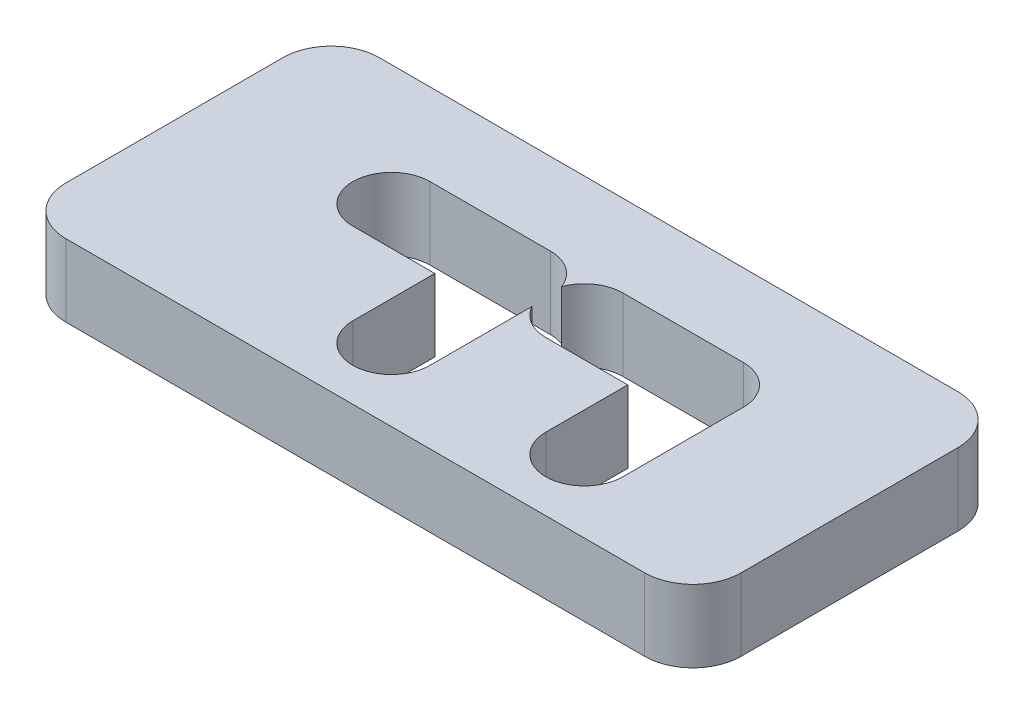
ISO-10303-21;
HEADER;
FILE_DESCRIPTION(('STEP AP214'),'2;1');
FILE_NAME('part.step','',(''),(''),'','','');
FILE_SCHEMA(('AUTOMOTIVE_DESIGN { 1 0 10303 214 1 1 1 1 }'));
ENDSEC;
DATA;
#1=APPLICATION_CONTEXT('core data for automotive mechanical design processes');
#2=APPLICATION_PROTOCOL_DEFINITION('international standard','automotive_design',2000,#1);
#3=PRODUCT_CONTEXT('',#1,'mechanical');
#4=PRODUCT('Part','Part','',(#3));
#5=PRODUCT_RELATED_PRODUCT_CATEGORY('part','',(#4));
#6=PRODUCT_DEFINITION_FORMATION('','',#4);
#7=PRODUCT_DEFINITION_CONTEXT('part definition',#1,'design');
#8=PRODUCT_DEFINITION('design','',#6,#7);
#9=PRODUCT_DEFINITION_SHAPE('','',#8);
#10=(LENGTH_UNIT() NAMED_UNIT(*) SI_UNIT(.MILLI.,.METRE.));
#11=(NAMED_UNIT(*) PLANE_ANGLE_UNIT() SI_UNIT($,.RADIAN.));
#12=(NAMED_UNIT(*) SI_UNIT($,.STERADIAN.) SOLID_ANGLE_UNIT());
#13=UNCERTAINTY_MEASURE_WITH_UNIT(LENGTH_MEASURE(1.E-05),#10,'distance_accuracy_value','');
#14=(GEOMETRIC_REPRESENTATION_CONTEXT(3) GLOBAL_UNCERTAINTY_ASSIGNED_CONTEXT((#13)) GLOBAL_UNIT_ASSIGNED_CONTEXT((#10,
#11,#12)) REPRESENTATION_CONTEXT('',''));
#15=CARTESIAN_POINT('',(0.,0.,0.));
#16=DIRECTION('',(0.,0.,1.));
#17=DIRECTION('',(1.,0.,0.));
#18=AXIS2_PLACEMENT_3D('',#15,#16,#17);
#19=CARTESIAN_POINT('',(14.,3.,0.));
#20=DIRECTION('',(-1.,0.,0.));
#21=DIRECTION('',(0.,0.,1.));
#22=AXIS2_PLACEMENT_3D('',#19,#20,#21);
#23=PLANE('',#22);
#24=DIRECTION('',(0.,0.,-1.));
#25=VECTOR('',#24,1.);
#26=CARTESIAN_POINT('',(14.,3.,0.));
#27=LINE('',#26,#25);
#28=CARTESIAN_POINT('',(14.,3.,-4.));
#29=VERTEX_POINT('',#28);
#30=CARTESIAN_POINT('',(14.,3.,-13.));
#31=VERTEX_POINT('',#30);
#32=EDGE_CURVE('E251',#29,#31,#27,.T.);
#33=ORIENTED_EDGE('',*,*,#32,.F.);
#34=DIRECTION('',(0.,1.,0.));
#35=VECTOR('',#34,1.);
#36=CARTESIAN_POINT('',(14.,3.,-4.));
#37=LINE('',#36,#35);
#38=CARTESIAN_POINT('',(14.,0.,-4.));
#39=VERTEX_POINT('',#38);
#40=EDGE_CURVE('E360',#29,#39,#37,.F.);
#41=ORIENTED_EDGE('',*,*,#40,.T.);
#42=DIRECTION('',(0.,0.,-1.));
#43=VECTOR('',#42,1.);
#44=CARTESIAN_POINT('',(14.,0.,0.));
#45=LINE('',#44,#43);
#46=CARTESIAN_POINT('',(14.,0.,-13.));
#47=VERTEX_POINT('',#46);
#48=EDGE_CURVE('E302',#39,#47,#45,.T.);
#49=ORIENTED_EDGE('',*,*,#48,.T.);
#50=DIRECTION('',(0.,-1.,0.));
#51=VECTOR('',#50,1.);
#52=CARTESIAN_POINT('',(14.,3.,-13.));
#53=LINE('',#52,#51);
#54=EDGE_CURVE('E358',#47,#31,#53,.F.);
#55=ORIENTED_EDGE('',*,*,#54,.T.);
#56=EDGE_LOOP('',(#33,#41,#49,#55));
#57=FACE_BOUND('',#56,.T.);
#58=ADVANCED_FACE('F35',(#57),#23,.F.);
#59=CARTESIAN_POINT('',(0.,3.,-15.));
#60=DIRECTION('',(0.,0.,-1.));
#61=DIRECTION('',(-1.,0.,0.));
#62=AXIS2_PLACEMENT_3D('',#59,#60,#61);
#63=PLANE('',#62);
#64=DIRECTION('',(1.,0.,0.));
#65=VECTOR('',#64,1.);
#66=CARTESIAN_POINT('',(0.,3.,-15.));
#67=LINE('',#66,#65);
#68=CARTESIAN_POINT('',(-12.,3.,-15.));
#69=VERTEX_POINT('',#68);
#70=CARTESIAN_POINT('',(12.,3.,-15.));
#71=VERTEX_POINT('',#70);
#72=EDGE_CURVE('E254',#69,#71,#67,.T.);
#73=ORIENTED_EDGE('',*,*,#72,.T.);
#74=DIRECTION('',(0.,-1.,0.));
#75=VECTOR('',#74,1.);
#76=CARTESIAN_POINT('',(12.,0.,-15.));
#77=LINE('',#76,#75);
#78=CARTESIAN_POINT('',(12.,0.,-15.));
#79=VERTEX_POINT('',#78);
#80=EDGE_CURVE('E11',#71,#79,#77,.T.);
#81=ORIENTED_EDGE('',*,*,#80,.T.);
#82=DIRECTION('',(1.,0.,0.));
#83=VECTOR('',#82,1.);
#84=CARTESIAN_POINT('',(0.,0.,-15.));
#85=LINE('',#84,#83);
#86=CARTESIAN_POINT('',(-12.,0.,-15.));
#87=VERTEX_POINT('',#86);
#88=EDGE_CURVE('E305',#87,#79,#85,.T.);
#89=ORIENTED_EDGE('',*,*,#88,.F.);
#90=DIRECTION('',(0.,-1.,0.));
#91=VECTOR('',#90,1.);
#92=CARTESIAN_POINT('',(-12.,3.,-15.));
#93=LINE('',#92,#91);
#94=EDGE_CURVE('E43',#87,#69,#93,.F.);
#95=ORIENTED_EDGE('',*,*,#94,.T.);
#96=EDGE_LOOP('',(#73,#81,#89,#95));
#97=FACE_BOUND('',#96,.T.);
#98=ADVANCED_FACE('F364',(#97),#63,.T.);
#99=CARTESIAN_POINT('',(-6.5,3.,-10.));
#100=DIRECTION('',(0.,-1.,0.));
#101=DIRECTION('',(0.,0.,-1.));
#102=AXIS2_PLACEMENT_3D('',#99,#100,#101);
#103=CYLINDRICAL_SURFACE('',#102,1.6);
#104=CARTESIAN_POINT('',(-6.5,0.,-10.));
#105=DIRECTION('',(0.,1.,0.));
#106=DIRECTION('',(0.,0.,1.));
#107=AXIS2_PLACEMENT_3D('',#104,#105,#106);
#108=CIRCLE('',#107,1.6);
#109=CARTESIAN_POINT('',(-6.5,0.,-11.6));
#110=VERTEX_POINT('',#109);
#111=CARTESIAN_POINT('',(-6.5,0.,-8.4));
#112=VERTEX_POINT('',#111);
#113=EDGE_CURVE('E196',#110,#112,#108,.T.);
#114=ORIENTED_EDGE('',*,*,#113,.F.);
#115=DIRECTION('',(0.,-1.,0.));
#116=VECTOR('',#115,1.);
#117=CARTESIAN_POINT('',(-6.5,3.,-11.6));
#118=LINE('',#117,#116);
#119=CARTESIAN_POINT('',(-6.5,3.,-11.6));
#120=VERTEX_POINT('',#119);
#121=EDGE_CURVE('E191',#120,#110,#118,.T.);
#122=ORIENTED_EDGE('',*,*,#121,.F.);
#123=CARTESIAN_POINT('',(-6.5,3.,-10.));
#124=DIRECTION('',(0.,1.,0.));
#125=DIRECTION('',(0.,0.,1.));
#126=AXIS2_PLACEMENT_3D('',#123,#124,#125);
#127=CIRCLE('',#126,1.6);
#128=CARTESIAN_POINT('',(-6.5,3.,-8.4));
#129=VERTEX_POINT('',#128);
#130=EDGE_CURVE('E194',#120,#129,#127,.T.);
#131=ORIENTED_EDGE('',*,*,#130,.T.);
#132=DIRECTION('',(0.,-1.,0.));
#133=VECTOR('',#132,1.);
#134=CARTESIAN_POINT('',(-6.5,3.,-8.4));
#135=LINE('',#134,#133);
#136=EDGE_CURVE('E260',#129,#112,#135,.T.);
#137=ORIENTED_EDGE('',*,*,#136,.T.);
#138=EDGE_LOOP('',(#114,#122,#131,#137));
#139=FACE_BOUND('',#138,.T.);
#140=ADVANCED_FACE('F193',(#139),#103,.F.);
#141=CARTESIAN_POINT('',(0.,3.,-11.6));
#142=DIRECTION('',(0.,0.,1.));
#143=DIRECTION('',(1.,0.,0.));
#144=AXIS2_PLACEMENT_3D('',#141,#142,#143);
#145=PLANE('',#144);
#146=DIRECTION('',(-1.,0.,0.));
#147=VECTOR('',#146,1.);
#148=CARTESIAN_POINT('',(0.,0.,-11.6));
#149=LINE('',#148,#147);
#150=CARTESIAN_POINT('',(-1.5,0.,-11.6));
#151=VERTEX_POINT('',#150);
#152=EDGE_CURVE('E262',#151,#110,#149,.T.);
#153=ORIENTED_EDGE('',*,*,#152,.F.);
#154=DIRECTION('',(0.,-1.,0.));
#155=VECTOR('',#154,1.);
#156=CARTESIAN_POINT('',(-1.5,3.,-11.6));
#157=LINE('',#156,#155);
#158=CARTESIAN_POINT('',(-1.5,3.,-11.6));
#159=VERTEX_POINT('',#158);
#160=EDGE_CURVE('E202',#159,#151,#157,.T.);
#161=ORIENTED_EDGE('',*,*,#160,.F.);
#162=DIRECTION('',(-1.,0.,0.));
#163=VECTOR('',#162,1.);
#164=CARTESIAN_POINT('',(0.,3.,-11.6));
#165=LINE('',#164,#163);
#166=EDGE_CURVE('E208',#159,#120,#165,.T.);
#167=ORIENTED_EDGE('',*,*,#166,.T.);
#168=ORIENTED_EDGE('',*,*,#121,.T.);
#169=EDGE_LOOP('',(#153,#161,#167,#168));
#170=FACE_BOUND('',#169,.T.);
#171=ADVANCED_FACE('F216',(#170),#145,.T.);
#172=CARTESIAN_POINT('',(-1.5,3.,-10.));
#173=DIRECTION('',(0.,-1.,0.));
#174=DIRECTION('',(0.,0.,-1.));
#175=AXIS2_PLACEMENT_3D('',#172,#173,#174);
#176=CYLINDRICAL_SURFACE('',#175,1.6);
#177=CARTESIAN_POINT('',(-1.5,0.,-10.));
#178=DIRECTION('',(0.,1.,0.));
#179=DIRECTION('',(0.,0.,1.));
#180=AXIS2_PLACEMENT_3D('',#177,#178,#179);
#181=CIRCLE('',#180,1.6);
#182=CARTESIAN_POINT('',(0.,0.,-10.556776436283));
#183=VERTEX_POINT('',#182);
#184=EDGE_CURVE('E265',#183,#151,#181,.T.);
#185=ORIENTED_EDGE('',*,*,#184,.F.);
#186=DIRECTION('',(0.,-1.,0.));
#187=VECTOR('',#186,1.);
#188=CARTESIAN_POINT('',(0.,3.,-10.556776436283));
#189=LINE('',#188,#187);
#190=CARTESIAN_POINT('',(0.,3.,-10.556776436283));
#191=VERTEX_POINT('',#190);
#192=EDGE_CURVE('E331',#191,#183,#189,.T.);
#193=ORIENTED_EDGE('',*,*,#192,.F.);
#194=CARTESIAN_POINT('',(-1.5,3.,-10.));
#195=DIRECTION('',(0.,1.,0.));
#196=DIRECTION('',(0.,0.,1.));
#197=AXIS2_PLACEMENT_3D('',#194,#195,#196);
#198=CIRCLE('',#197,1.6);
#199=EDGE_CURVE('E217',#191,#159,#198,.T.);
#200=ORIENTED_EDGE('',*,*,#199,.T.);
#201=ORIENTED_EDGE('',*,*,#160,.T.);
#202=EDGE_LOOP('',(#185,#193,#200,#201));
#203=FACE_BOUND('',#202,.T.);
#204=ADVANCED_FACE('F456',(#203),#176,.F.);
#205=CARTESIAN_POINT('',(1.5,3.,-10.));
#206=DIRECTION('',(0.,-1.,0.));
#207=DIRECTION('',(0.,0.,-1.));
#208=AXIS2_PLACEMENT_3D('',#205,#206,#207);
#209=CYLINDRICAL_SURFACE('',#208,1.6);
#210=CARTESIAN_POINT('',(1.5,0.,-10.));
#211=DIRECTION('',(0.,1.,0.));
#212=DIRECTION('',(0.,0.,1.));
#213=AXIS2_PLACEMENT_3D('',#210,#211,#212);
#214=CIRCLE('',#213,1.6);
#215=CARTESIAN_POINT('',(1.5,0.,-11.6));
#216=VERTEX_POINT('',#215);
#217=EDGE_CURVE('E268',#216,#183,#214,.T.);
#218=ORIENTED_EDGE('',*,*,#217,.F.);
#219=DIRECTION('',(0.,-1.,0.));
#220=VECTOR('',#219,1.);
#221=CARTESIAN_POINT('',(1.5,3.,-11.6));
#222=LINE('',#221,#220);
#223=CARTESIAN_POINT('',(1.5,3.,-11.6));
#224=VERTEX_POINT('',#223);
#225=EDGE_CURVE('E329',#224,#216,#222,.T.);
#226=ORIENTED_EDGE('',*,*,#225,.F.);
#227=CARTESIAN_POINT('',(1.5,3.,-10.));
#228=DIRECTION('',(0.,1.,0.));
#229=DIRECTION('',(0.,0.,1.));
#230=AXIS2_PLACEMENT_3D('',#227,#228,#229);
#231=CIRCLE('',#230,1.6);
#232=EDGE_CURVE('E219',#224,#191,#231,.T.);
#233=ORIENTED_EDGE('',*,*,#232,.T.);
#234=ORIENTED_EDGE('',*,*,#192,.T.);
#235=EDGE_LOOP('',(#218,#226,#233,#234));
#236=FACE_BOUND('',#235,.T.);
#237=ADVANCED_FACE('F432',(#236),#209,.F.);
#238=CARTESIAN_POINT('',(0.,3.,-11.6));
#239=DIRECTION('',(0.,0.,1.));
#240=DIRECTION('',(1.,0.,0.));
#241=AXIS2_PLACEMENT_3D('',#238,#239,#240);
#242=PLANE('',#241);
#243=DIRECTION('',(-1.,0.,0.));
#244=VECTOR('',#243,1.);
#245=CARTESIAN_POINT('',(0.,0.,-11.6));
#246=LINE('',#245,#244);
#247=CARTESIAN_POINT('',(6.5,0.,-11.6));
#248=VERTEX_POINT('',#247);
#249=EDGE_CURVE('E271',#248,#216,#246,.T.);
#250=ORIENTED_EDGE('',*,*,#249,.F.);
#251=DIRECTION('',(0.,-1.,0.));
#252=VECTOR('',#251,1.);
#253=CARTESIAN_POINT('',(6.5,3.,-11.6));
#254=LINE('',#253,#252);
#255=CARTESIAN_POINT('',(6.5,3.,-11.6));
#256=VERTEX_POINT('',#255);
#257=EDGE_CURVE('E327',#256,#248,#254,.T.);
#258=ORIENTED_EDGE('',*,*,#257,.F.);
#259=DIRECTION('',(-1.,0.,0.));
#260=VECTOR('',#259,1.);
#261=CARTESIAN_POINT('',(0.,3.,-11.6));
#262=LINE('',#261,#260);
#263=EDGE_CURVE('E225',#256,#224,#262,.T.);
#264=ORIENTED_EDGE('',*,*,#263,.T.);
#265=ORIENTED_EDGE('',*,*,#225,.T.);
#266=EDGE_LOOP('',(#250,#258,#264,#265));
#267=FACE_BOUND('',#266,.T.);
#268=ADVANCED_FACE('F451',(#267),#242,.T.);
#269=CARTESIAN_POINT('',(6.5,3.,-10.));
#270=DIRECTION('',(0.,-1.,0.));
#271=DIRECTION('',(0.,0.,-1.));
#272=AXIS2_PLACEMENT_3D('',#269,#270,#271);
#273=CYLINDRICAL_SURFACE('',#272,1.6);
#274=CARTESIAN_POINT('',(6.5,0.,-10.));
#275=DIRECTION('',(0.,1.,0.));
#276=DIRECTION('',(0.,0.,1.));
#277=AXIS2_PLACEMENT_3D('',#274,#275,#276);
#278=CIRCLE('',#277,1.6);
#279=CARTESIAN_POINT('',(8.1,0.,-10.));
#280=VERTEX_POINT('',#279);
#281=EDGE_CURVE('E275',#280,#248,#278,.T.);
#282=ORIENTED_EDGE('',*,*,#281,.F.);
#283=DIRECTION('',(0.,-1.,0.));
#284=VECTOR('',#283,1.);
#285=CARTESIAN_POINT('',(8.1,3.,-10.));
#286=LINE('',#285,#284);
#287=CARTESIAN_POINT('',(8.1,3.,-10.));
#288=VERTEX_POINT('',#287);
#289=EDGE_CURVE('E325',#288,#280,#286,.T.);
#290=ORIENTED_EDGE('',*,*,#289,.F.);
#291=CARTESIAN_POINT('',(6.5,3.,-10.));
#292=DIRECTION('',(0.,1.,0.));
#293=DIRECTION('',(0.,0.,1.));
#294=AXIS2_PLACEMENT_3D('',#291,#292,#293);
#295=CIRCLE('',#294,1.6);
#296=EDGE_CURVE('E229',#288,#256,#295,.T.);
#297=ORIENTED_EDGE('',*,*,#296,.T.);
#298=ORIENTED_EDGE('',*,*,#257,.T.);
#299=EDGE_LOOP('',(#282,#290,#297,#298));
#300=FACE_BOUND('',#299,.T.);
#301=ADVANCED_FACE('F447',(#300),#273,.F.);
#302=CARTESIAN_POINT('',(8.10000000000001,3.,0.));
#303=DIRECTION('',(1.,0.,0.));
#304=DIRECTION('',(0.,0.,-1.));
#305=AXIS2_PLACEMENT_3D('',#302,#303,#304);
#306=PLANE('',#305);
#307=DIRECTION('',(0.,0.,1.));
#308=VECTOR('',#307,1.);
#309=CARTESIAN_POINT('',(8.10000000000001,0.,0.));
#310=LINE('',#309,#308);
#311=CARTESIAN_POINT('',(8.1,0.,-5.));
#312=VERTEX_POINT('',#311);
#313=EDGE_CURVE('E278',#280,#312,#310,.T.);
#314=ORIENTED_EDGE('',*,*,#313,.T.);
#315=DIRECTION('',(0.,-1.,0.));
#316=VECTOR('',#315,1.);
#317=CARTESIAN_POINT('',(8.1,3.,-5.));
#318=LINE('',#317,#316);
#319=CARTESIAN_POINT('',(8.1,3.,-5.));
#320=VERTEX_POINT('',#319);
#321=EDGE_CURVE('E323',#320,#312,#318,.T.);
#322=ORIENTED_EDGE('',*,*,#321,.F.);
#323=DIRECTION('',(0.,0.,1.));
#324=VECTOR('',#323,1.);
#325=CARTESIAN_POINT('',(8.10000000000001,3.,0.));
#326=LINE('',#325,#324);
#327=EDGE_CURVE('E232',#288,#320,#326,.T.);
#328=ORIENTED_EDGE('',*,*,#327,.F.);
#329=ORIENTED_EDGE('',*,*,#289,.T.);
#330=EDGE_LOOP('',(#314,#322,#328,#329));
#331=FACE_BOUND('',#330,.T.);
#332=ADVANCED_FACE('F443',(#331),#306,.F.);
#333=CARTESIAN_POINT('',(6.5,3.,-5.));
#334=DIRECTION('',(0.,-1.,0.));
#335=DIRECTION('',(0.,0.,-1.));
#336=AXIS2_PLACEMENT_3D('',#333,#334,#335);
#337=CYLINDRICAL_SURFACE('',#336,1.6);
#338=CARTESIAN_POINT('',(6.5,0.,-5.));
#339=DIRECTION('',(0.,1.,0.));
#340=DIRECTION('',(0.,0.,1.));
#341=AXIS2_PLACEMENT_3D('',#338,#339,#340);
#342=CIRCLE('',#341,1.6);
#343=CARTESIAN_POINT('',(4.9,0.,-5.));
#344=VERTEX_POINT('',#343);
#345=EDGE_CURVE('E281',#344,#312,#342,.T.);
#346=ORIENTED_EDGE('',*,*,#345,.F.);
#347=DIRECTION('',(0.,-1.,0.));
#348=VECTOR('',#347,1.);
#349=CARTESIAN_POINT('',(4.9,3.,-5.));
#350=LINE('',#349,#348);
#351=CARTESIAN_POINT('',(4.9,3.,-5.));
#352=VERTEX_POINT('',#351);
#353=EDGE_CURVE('E321',#352,#344,#350,.T.);
#354=ORIENTED_EDGE('',*,*,#353,.F.);
#355=CARTESIAN_POINT('',(6.5,3.,-5.));
#356=DIRECTION('',(0.,1.,0.));
#357=DIRECTION('',(0.,0.,1.));
#358=AXIS2_PLACEMENT_3D('',#355,#356,#357);
#359=CIRCLE('',#358,1.6);
#360=EDGE_CURVE('E234',#352,#320,#359,.T.);
#361=ORIENTED_EDGE('',*,*,#360,.T.);
#362=ORIENTED_EDGE('',*,*,#321,.T.);
#363=EDGE_LOOP('',(#346,#354,#361,#362));
#364=FACE_BOUND('',#363,.T.);
#365=ADVANCED_FACE('F439',(#364),#337,.F.);
#366=CARTESIAN_POINT('',(4.9,3.,0.));
#367=DIRECTION('',(1.,0.,0.));
#368=DIRECTION('',(0.,0.,-1.));
#369=AXIS2_PLACEMENT_3D('',#366,#367,#368);
#370=PLANE('',#369);
#371=DIRECTION('',(0.,0.,1.));
#372=VECTOR('',#371,1.);
#373=CARTESIAN_POINT('',(4.9,0.,0.));
#374=LINE('',#373,#372);
#375=CARTESIAN_POINT('',(4.9,0.,-8.4));
#376=VERTEX_POINT('',#375);
#377=EDGE_CURVE('E284',#376,#344,#374,.T.);
#378=ORIENTED_EDGE('',*,*,#377,.F.);
#379=DIRECTION('',(0.,-1.,0.));
#380=VECTOR('',#379,1.);
#381=CARTESIAN_POINT('',(4.9,3.,-8.4));
#382=LINE('',#381,#380);
#383=CARTESIAN_POINT('',(4.9,3.,-8.4));
#384=VERTEX_POINT('',#383);
#385=EDGE_CURVE('E319',#384,#376,#382,.T.);
#386=ORIENTED_EDGE('',*,*,#385,.F.);
#387=DIRECTION('',(0.,0.,1.));
#388=VECTOR('',#387,1.);
#389=CARTESIAN_POINT('',(4.9,3.,0.));
#390=LINE('',#389,#388);
#391=EDGE_CURVE('E237',#384,#352,#390,.T.);
#392=ORIENTED_EDGE('',*,*,#391,.T.);
#393=ORIENTED_EDGE('',*,*,#353,.T.);
#394=EDGE_LOOP('',(#378,#386,#392,#393));
#395=FACE_BOUND('',#394,.T.);
#396=ADVANCED_FACE('F435',(#395),#370,.T.);
#397=CARTESIAN_POINT('',(0.,3.,-8.4));
#398=DIRECTION('',(0.,0.,1.));
#399=DIRECTION('',(1.,0.,0.));
#400=AXIS2_PLACEMENT_3D('',#397,#398,#399);
#401=PLANE('',#400);
#402=DIRECTION('',(-1.,0.,0.));
#403=VECTOR('',#402,1.);
#404=CARTESIAN_POINT('',(0.,0.,-8.4));
#405=LINE('',#404,#403);
#406=CARTESIAN_POINT('',(1.5,0.,-8.4));
#407=VERTEX_POINT('',#406);
#408=EDGE_CURVE('E287',#376,#407,#405,.T.);
#409=ORIENTED_EDGE('',*,*,#408,.T.);
#410=DIRECTION('',(0.,-1.,0.));
#411=VECTOR('',#410,1.);
#412=CARTESIAN_POINT('',(1.5,3.,-8.4));
#413=LINE('',#412,#411);
#414=CARTESIAN_POINT('',(1.5,3.,-8.4));
#415=VERTEX_POINT('',#414);
#416=EDGE_CURVE('E317',#415,#407,#413,.T.);
#417=ORIENTED_EDGE('',*,*,#416,.F.);
#418=DIRECTION('',(-1.,0.,0.));
#419=VECTOR('',#418,1.);
#420=CARTESIAN_POINT('',(0.,3.,-8.4));
#421=LINE('',#420,#419);
#422=EDGE_CURVE('E240',#384,#415,#421,.T.);
#423=ORIENTED_EDGE('',*,*,#422,.F.);
#424=ORIENTED_EDGE('',*,*,#385,.T.);
#425=EDGE_LOOP('',(#409,#417,#423,#424));
#426=FACE_BOUND('',#425,.T.);
#427=ADVANCED_FACE('F430',(#426),#401,.F.);
#428=CARTESIAN_POINT('',(0.100000000000003,0.,-9.22540333075851));
#429=VERTEX_POINT('',#428);
#430=EDGE_CURVE('E272',#429,#407,#214,.T.);
#431=ORIENTED_EDGE('',*,*,#430,.F.);
#432=DIRECTION('',(0.,-1.,0.));
#433=VECTOR('',#432,1.);
#434=CARTESIAN_POINT('',(0.100000000000003,3.,-9.22540333075851));
#435=LINE('',#434,#433);
#436=CARTESIAN_POINT('',(0.100000000000003,3.,-9.22540333075851));
#437=VERTEX_POINT('',#436);
#438=EDGE_CURVE('E315',#437,#429,#435,.T.);
#439=ORIENTED_EDGE('',*,*,#438,.F.);
#440=EDGE_CURVE('E226',#437,#415,#231,.T.);
#441=ORIENTED_EDGE('',*,*,#440,.T.);
#442=ORIENTED_EDGE('',*,*,#416,.T.);
#443=EDGE_LOOP('',(#431,#439,#441,#442));
#444=FACE_BOUND('',#443,.T.);
#445=ADVANCED_FACE('F426',(#444),#209,.F.);
#446=CARTESIAN_POINT('',(0.100000000000004,3.,0.));
#447=DIRECTION('',(1.,0.,0.));
#448=DIRECTION('',(0.,0.,-1.));
#449=AXIS2_PLACEMENT_3D('',#446,#447,#448);
#450=PLANE('',#449);
#451=DIRECTION('',(0.,0.,1.));
#452=VECTOR('',#451,1.);
#453=CARTESIAN_POINT('',(0.100000000000004,0.,0.));
#454=LINE('',#453,#452);
#455=CARTESIAN_POINT('',(0.100000000000003,0.,-5.));
#456=VERTEX_POINT('',#455);
#457=EDGE_CURVE('E290',#429,#456,#454,.T.);
#458=ORIENTED_EDGE('',*,*,#457,.T.);
#459=DIRECTION('',(0.,-1.,0.));
#460=VECTOR('',#459,1.);
#461=CARTESIAN_POINT('',(0.100000000000003,3.,-5.));
#462=LINE('',#461,#460);
#463=CARTESIAN_POINT('',(0.100000000000003,3.,-5.));
#464=VERTEX_POINT('',#463);
#465=EDGE_CURVE('E313',#464,#456,#462,.T.);
#466=ORIENTED_EDGE('',*,*,#465,.F.);
#467=DIRECTION('',(0.,0.,1.));
#468=VECTOR('',#467,1.);
#469=CARTESIAN_POINT('',(0.100000000000004,3.,0.));
#470=LINE('',#469,#468);
#471=EDGE_CURVE('E242',#437,#464,#470,.T.);
#472=ORIENTED_EDGE('',*,*,#471,.F.);
#473=ORIENTED_EDGE('',*,*,#438,.T.);
#474=EDGE_LOOP('',(#458,#466,#472,#473));
#475=FACE_BOUND('',#474,.T.);
#476=ADVANCED_FACE('F422',(#475),#450,.F.);
#477=CARTESIAN_POINT('',(-1.5,3.,-5.));
#478=DIRECTION('',(0.,-1.,0.));
#479=DIRECTION('',(0.,0.,-1.));
#480=AXIS2_PLACEMENT_3D('',#477,#478,#479);
#481=CYLINDRICAL_SURFACE('',#480,1.6);
#482=CARTESIAN_POINT('',(-1.5,0.,-5.));
#483=DIRECTION('',(0.,1.,0.));
#484=DIRECTION('',(0.,0.,1.));
#485=AXIS2_PLACEMENT_3D('',#482,#483,#484);
#486=CIRCLE('',#485,1.6);
#487=CARTESIAN_POINT('',(-3.1,0.,-5.));
#488=VERTEX_POINT('',#487);
#489=EDGE_CURVE('E293',#488,#456,#486,.T.);
#490=ORIENTED_EDGE('',*,*,#489,.F.);
#491=DIRECTION('',(0.,-1.,0.));
#492=VECTOR('',#491,1.);
#493=CARTESIAN_POINT('',(-3.1,3.,-5.));
#494=LINE('',#493,#492);
#495=CARTESIAN_POINT('',(-3.1,3.,-5.));
#496=VERTEX_POINT('',#495);
#497=EDGE_CURVE('E311',#496,#488,#494,.T.);
#498=ORIENTED_EDGE('',*,*,#497,.F.);
#499=CARTESIAN_POINT('',(-1.5,3.,-5.));
#500=DIRECTION('',(0.,1.,0.));
#501=DIRECTION('',(0.,0.,1.));
#502=AXIS2_PLACEMENT_3D('',#499,#500,#501);
#503=CIRCLE('',#502,1.6);
#504=EDGE_CURVE('E244',#496,#464,#503,.T.);
#505=ORIENTED_EDGE('',*,*,#504,.T.);
#506=ORIENTED_EDGE('',*,*,#465,.T.);
#507=EDGE_LOOP('',(#490,#498,#505,#506));
#508=FACE_BOUND('',#507,.T.);
#509=ADVANCED_FACE('F418',(#508),#481,.F.);
#510=CARTESIAN_POINT('',(-3.1,3.,0.));
#511=DIRECTION('',(1.,0.,0.));
#512=DIRECTION('',(0.,0.,-1.));
#513=AXIS2_PLACEMENT_3D('',#510,#511,#512);
#514=PLANE('',#513);
#515=DIRECTION('',(0.,0.,1.));
#516=VECTOR('',#515,1.);
#517=CARTESIAN_POINT('',(-3.1,0.,0.));
#518=LINE('',#517,#516);
#519=CARTESIAN_POINT('',(-3.1,0.,-8.4));
#520=VERTEX_POINT('',#519);
#521=EDGE_CURVE('E296',#520,#488,#518,.T.);
#522=ORIENTED_EDGE('',*,*,#521,.F.);
#523=DIRECTION('',(0.,-1.,0.));
#524=VECTOR('',#523,1.);
#525=CARTESIAN_POINT('',(-3.1,3.,-8.4));
#526=LINE('',#525,#524);
#527=CARTESIAN_POINT('',(-3.1,3.,-8.4));
#528=VERTEX_POINT('',#527);
#529=EDGE_CURVE('E309',#528,#520,#526,.T.);
#530=ORIENTED_EDGE('',*,*,#529,.F.);
#531=DIRECTION('',(0.,0.,1.));
#532=VECTOR('',#531,1.);
#533=CARTESIAN_POINT('',(-3.1,3.,0.));
#534=LINE('',#533,#532);
#535=EDGE_CURVE('E247',#528,#496,#534,.T.);
#536=ORIENTED_EDGE('',*,*,#535,.T.);
#537=ORIENTED_EDGE('',*,*,#497,.T.);
#538=EDGE_LOOP('',(#522,#530,#536,#537));
#539=FACE_BOUND('',#538,.T.);
#540=ADVANCED_FACE('F414',(#539),#514,.T.);
#541=CARTESIAN_POINT('',(0.,3.,-8.4));
#542=DIRECTION('',(0.,0.,1.));
#543=DIRECTION('',(1.,0.,0.));
#544=AXIS2_PLACEMENT_3D('',#541,#542,#543);
#545=PLANE('',#544);
#546=DIRECTION('',(-1.,0.,0.));
#547=VECTOR('',#546,1.);
#548=CARTESIAN_POINT('',(0.,0.,-8.4));
#549=LINE('',#548,#547);
#550=EDGE_CURVE('E299',#520,#112,#549,.T.);
#551=ORIENTED_EDGE('',*,*,#550,.T.);
#552=ORIENTED_EDGE('',*,*,#136,.F.);
#553=DIRECTION('',(-1.,0.,0.));
#554=VECTOR('',#553,1.);
#555=CARTESIAN_POINT('',(0.,3.,-8.4));
#556=LINE('',#555,#554);
#557=EDGE_CURVE('E212',#528,#129,#556,.T.);
#558=ORIENTED_EDGE('',*,*,#557,.F.);
#559=ORIENTED_EDGE('',*,*,#529,.T.);
#560=EDGE_LOOP('',(#551,#552,#558,#559));
#561=FACE_BOUND('',#560,.T.);
#562=ADVANCED_FACE('F411',(#561),#545,.F.);
#563=CARTESIAN_POINT('',(-14.,3.,0.));
#564=DIRECTION('',(-1.,0.,0.));
#565=DIRECTION('',(0.,0.,1.));
#566=AXIS2_PLACEMENT_3D('',#563,#564,#565);
#567=PLANE('',#566);
#568=DIRECTION('',(0.,0.,-1.));
#569=VECTOR('',#568,1.);
#570=CARTESIAN_POINT('',(-14.,0.,0.));
#571=LINE('',#570,#569);
#572=CARTESIAN_POINT('',(-14.,0.,-4.));
#573=VERTEX_POINT('',#572);
#574=CARTESIAN_POINT('',(-14.,0.,-13.));
#575=VERTEX_POINT('',#574);
#576=EDGE_CURVE('E214',#573,#575,#571,.T.);
#577=ORIENTED_EDGE('',*,*,#576,.F.);
#578=DIRECTION('',(0.,1.,0.));
#579=VECTOR('',#578,1.);
#580=CARTESIAN_POINT('',(-14.,3.,-4.));
#581=LINE('',#580,#579);
#582=CARTESIAN_POINT('',(-14.,3.,-4.));
#583=VERTEX_POINT('',#582);
#584=EDGE_CURVE('E336',#573,#583,#581,.T.);
#585=ORIENTED_EDGE('',*,*,#584,.T.);
#586=DIRECTION('',(0.,0.,-1.));
#587=VECTOR('',#586,1.);
#588=CARTESIAN_POINT('',(-14.,3.,0.));
#589=LINE('',#588,#587);
#590=CARTESIAN_POINT('',(-14.,3.,-13.));
#591=VERTEX_POINT('',#590);
#592=EDGE_CURVE('E257',#583,#591,#589,.T.);
#593=ORIENTED_EDGE('',*,*,#592,.T.);
#594=DIRECTION('',(0.,-1.,0.));
#595=VECTOR('',#594,1.);
#596=CARTESIAN_POINT('',(-14.,3.,-13.));
#597=LINE('',#596,#595);
#598=EDGE_CURVE('E201',#591,#575,#597,.T.);
#599=ORIENTED_EDGE('',*,*,#598,.T.);
#600=EDGE_LOOP('',(#577,#585,#593,#599));
#601=FACE_BOUND('',#600,.T.);
#602=ADVANCED_FACE('F373',(#601),#567,.T.);
#603=CARTESIAN_POINT('',(0.,3.,0.));
#604=DIRECTION('',(0.,1.,0.));
#605=DIRECTION('',(0.,0.,1.));
#606=AXIS2_PLACEMENT_3D('',#603,#604,#605);
#607=PLANE('',#606);
#608=ORIENTED_EDGE('',*,*,#592,.F.);
#609=CARTESIAN_POINT('',(-12.,3.,-4.));
#610=DIRECTION('',(0.,1.,0.));
#611=DIRECTION('',(0.,0.,1.));
#612=AXIS2_PLACEMENT_3D('',#609,#610,#611);
#613=CIRCLE('',#612,2.);
#614=CARTESIAN_POINT('',(-12.,3.,-2.));
#615=VERTEX_POINT('',#614);
#616=EDGE_CURVE('E345',#583,#615,#613,.T.);
#617=ORIENTED_EDGE('',*,*,#616,.T.);
#618=DIRECTION('',(-1.,0.,0.));
#619=VECTOR('',#618,1.);
#620=CARTESIAN_POINT('',(-14.,3.,-2.));
#621=LINE('',#620,#619);
#622=CARTESIAN_POINT('',(12.,3.,-2.));
#623=VERTEX_POINT('',#622);
#624=EDGE_CURVE('E384',#623,#615,#621,.T.);
#625=ORIENTED_EDGE('',*,*,#624,.F.);
#626=CARTESIAN_POINT('',(12.,3.,-4.));
#627=DIRECTION('',(0.,1.,0.));
#628=DIRECTION('',(0.,0.,1.));
#629=AXIS2_PLACEMENT_3D('',#626,#627,#628);
#630=CIRCLE('',#629,2.);
#631=EDGE_CURVE('E343',#623,#29,#630,.T.);
#632=ORIENTED_EDGE('',*,*,#631,.T.);
#633=ORIENTED_EDGE('',*,*,#32,.T.);
#634=CARTESIAN_POINT('',(12.,3.,-13.));
#635=DIRECTION('',(0.,1.,0.));
#636=DIRECTION('',(0.,0.,1.));
#637=AXIS2_PLACEMENT_3D('',#634,#635,#636);
#638=CIRCLE('',#637,2.);
#639=EDGE_CURVE('E341',#31,#71,#638,.T.);
#640=ORIENTED_EDGE('',*,*,#639,.T.);
#641=ORIENTED_EDGE('',*,*,#72,.F.);
#642=CARTESIAN_POINT('',(-12.,3.,-13.));
#643=DIRECTION('',(0.,1.,0.));
#644=DIRECTION('',(0.,0.,1.));
#645=AXIS2_PLACEMENT_3D('',#642,#643,#644);
#646=CIRCLE('',#645,2.);
#647=EDGE_CURVE('E339',#69,#591,#646,.T.);
#648=ORIENTED_EDGE('',*,*,#647,.T.);
#649=EDGE_LOOP('',(#608,#617,#625,#632,#633,#640,#641,#648));
#650=FACE_BOUND('',#649,.T.);
#651=ORIENTED_EDGE('',*,*,#130,.F.);
#652=ORIENTED_EDGE('',*,*,#166,.F.);
#653=ORIENTED_EDGE('',*,*,#199,.F.);
#654=ORIENTED_EDGE('',*,*,#232,.F.);
#655=ORIENTED_EDGE('',*,*,#263,.F.);
#656=ORIENTED_EDGE('',*,*,#296,.F.);
#657=ORIENTED_EDGE('',*,*,#327,.T.);
#658=ORIENTED_EDGE('',*,*,#360,.F.);
#659=ORIENTED_EDGE('',*,*,#391,.F.);
#660=ORIENTED_EDGE('',*,*,#422,.T.);
#661=ORIENTED_EDGE('',*,*,#440,.F.);
#662=ORIENTED_EDGE('',*,*,#471,.T.);
#663=ORIENTED_EDGE('',*,*,#504,.F.);
#664=ORIENTED_EDGE('',*,*,#535,.F.);
#665=ORIENTED_EDGE('',*,*,#557,.T.);
#666=EDGE_LOOP('',(#651,#652,#653,#654,#655,#656,#657,#658,#659,#660,#661,#662,#663,#664,#665));
#667=FACE_BOUND('',#666,.T.);
#668=ADVANCED_FACE('F206',(#650,#667),#607,.T.);
#669=CARTESIAN_POINT('',(0.,0.,0.));
#670=DIRECTION('',(0.,1.,0.));
#671=DIRECTION('',(0.,0.,1.));
#672=AXIS2_PLACEMENT_3D('',#669,#670,#671);
#673=PLANE('',#672);
#674=ORIENTED_EDGE('',*,*,#113,.T.);
#675=ORIENTED_EDGE('',*,*,#550,.F.);
#676=ORIENTED_EDGE('',*,*,#521,.T.);
#677=ORIENTED_EDGE('',*,*,#489,.T.);
#678=ORIENTED_EDGE('',*,*,#457,.F.);
#679=ORIENTED_EDGE('',*,*,#430,.T.);
#680=ORIENTED_EDGE('',*,*,#408,.F.);
#681=ORIENTED_EDGE('',*,*,#377,.T.);
#682=ORIENTED_EDGE('',*,*,#345,.T.);
#683=ORIENTED_EDGE('',*,*,#313,.F.);
#684=ORIENTED_EDGE('',*,*,#281,.T.);
#685=ORIENTED_EDGE('',*,*,#249,.T.);
#686=ORIENTED_EDGE('',*,*,#217,.T.);
#687=ORIENTED_EDGE('',*,*,#184,.T.);
#688=ORIENTED_EDGE('',*,*,#152,.T.);
#689=EDGE_LOOP('',(#674,#675,#676,#677,#678,#679,#680,#681,#682,#683,#684,#685,#686,#687,#688));
#690=FACE_BOUND('',#689,.T.);
#691=DIRECTION('',(-1.,0.,0.));
#692=VECTOR('',#691,1.);
#693=CARTESIAN_POINT('',(-14.,0.,-2.));
#694=LINE('',#693,#692);
#695=CARTESIAN_POINT('',(12.,0.,-2.));
#696=VERTEX_POINT('',#695);
#697=CARTESIAN_POINT('',(-12.,0.,-2.));
#698=VERTEX_POINT('',#697);
#699=EDGE_CURVE('E263',#696,#698,#694,.T.);
#700=ORIENTED_EDGE('',*,*,#699,.T.);
#701=CARTESIAN_POINT('',(-12.,0.,-4.));
#702=DIRECTION('',(0.,1.,0.));
#703=DIRECTION('',(0.,0.,1.));
#704=AXIS2_PLACEMENT_3D('',#701,#702,#703);
#705=CIRCLE('',#704,2.);
#706=EDGE_CURVE('E356',#698,#573,#705,.F.);
#707=ORIENTED_EDGE('',*,*,#706,.T.);
#708=ORIENTED_EDGE('',*,*,#576,.T.);
#709=CARTESIAN_POINT('',(-12.,0.,-13.));
#710=DIRECTION('',(0.,1.,0.));
#711=DIRECTION('',(0.,0.,1.));
#712=AXIS2_PLACEMENT_3D('',#709,#710,#711);
#713=CIRCLE('',#712,2.);
#714=EDGE_CURVE('E57',#575,#87,#713,.F.);
#715=ORIENTED_EDGE('',*,*,#714,.T.);
#716=ORIENTED_EDGE('',*,*,#88,.T.);
#717=CARTESIAN_POINT('',(12.,0.,-13.));
#718=DIRECTION('',(0.,1.,0.));
#719=DIRECTION('',(0.,0.,1.));
#720=AXIS2_PLACEMENT_3D('',#717,#718,#719);
#721=CIRCLE('',#720,2.);
#722=EDGE_CURVE('E50',#79,#47,#721,.F.);
#723=ORIENTED_EDGE('',*,*,#722,.T.);
#724=ORIENTED_EDGE('',*,*,#48,.F.);
#725=CARTESIAN_POINT('',(12.,0.,-4.));
#726=DIRECTION('',(0.,1.,0.));
#727=DIRECTION('',(0.,0.,1.));
#728=AXIS2_PLACEMENT_3D('',#725,#726,#727);
#729=CIRCLE('',#728,2.);
#730=EDGE_CURVE('E354',#39,#696,#729,.F.);
#731=ORIENTED_EDGE('',*,*,#730,.T.);
#732=EDGE_LOOP('',(#700,#707,#708,#715,#716,#723,#724,#731));
#733=FACE_BOUND('',#732,.T.);
#734=ADVANCED_FACE('F376',(#690,#733),#673,.F.);
#735=CARTESIAN_POINT('',(-14.,0.,-2.));
#736=DIRECTION('',(0.,0.,-1.));
#737=DIRECTION('',(-1.,0.,0.));
#738=AXIS2_PLACEMENT_3D('',#735,#736,#737);
#739=PLANE('',#738);
#740=ORIENTED_EDGE('',*,*,#624,.T.);
#741=DIRECTION('',(0.,1.,0.));
#742=VECTOR('',#741,1.);
#743=CARTESIAN_POINT('',(-12.,0.,-2.));
#744=LINE('',#743,#742);
#745=EDGE_CURVE('E350',#615,#698,#744,.F.);
#746=ORIENTED_EDGE('',*,*,#745,.T.);
#747=ORIENTED_EDGE('',*,*,#699,.F.);
#748=DIRECTION('',(0.,1.,0.));
#749=VECTOR('',#748,1.);
#750=CARTESIAN_POINT('',(12.,0.,-2.));
#751=LINE('',#750,#749);
#752=EDGE_CURVE('E347',#696,#623,#751,.T.);
#753=ORIENTED_EDGE('',*,*,#752,.T.);
#754=EDGE_LOOP('',(#740,#746,#747,#753));
#755=FACE_BOUND('',#754,.T.);
#756=ADVANCED_FACE('F386',(#755),#739,.F.);
#757=CARTESIAN_POINT('',(-12.,3.,-4.));
#758=DIRECTION('',(0.,-1.,0.));
#759=DIRECTION('',(0.,0.,-1.));
#760=AXIS2_PLACEMENT_3D('',#757,#758,#759);
#761=CYLINDRICAL_SURFACE('',#760,2.);
#762=ORIENTED_EDGE('',*,*,#706,.F.);
#763=ORIENTED_EDGE('',*,*,#745,.F.);
#764=ORIENTED_EDGE('',*,*,#616,.F.);
#765=ORIENTED_EDGE('',*,*,#584,.F.);
#766=EDGE_LOOP('',(#762,#763,#764,#765));
#767=FACE_BOUND('',#766,.T.);
#768=ADVANCED_FACE('F381',(#767),#761,.T.);
#769=CARTESIAN_POINT('',(12.,0.,-4.));
#770=DIRECTION('',(0.,1.,0.));
#771=DIRECTION('',(0.,0.,1.));
#772=AXIS2_PLACEMENT_3D('',#769,#770,#771);
#773=CYLINDRICAL_SURFACE('',#772,2.);
#774=ORIENTED_EDGE('',*,*,#730,.F.);
#775=ORIENTED_EDGE('',*,*,#40,.F.);
#776=ORIENTED_EDGE('',*,*,#631,.F.);
#777=ORIENTED_EDGE('',*,*,#752,.F.);
#778=EDGE_LOOP('',(#774,#775,#776,#777));
#779=FACE_BOUND('',#778,.T.);
#780=ADVANCED_FACE('F391',(#779),#773,.T.);
#781=CARTESIAN_POINT('',(12.,3.,-13.));
#782=DIRECTION('',(0.,1.,0.));
#783=DIRECTION('',(0.,0.,1.));
#784=AXIS2_PLACEMENT_3D('',#781,#782,#783);
#785=CYLINDRICAL_SURFACE('',#784,2.);
#786=ORIENTED_EDGE('',*,*,#639,.F.);
#787=ORIENTED_EDGE('',*,*,#54,.F.);
#788=ORIENTED_EDGE('',*,*,#722,.F.);
#789=ORIENTED_EDGE('',*,*,#80,.F.);
#790=EDGE_LOOP('',(#786,#787,#788,#789));
#791=FACE_BOUND('',#790,.T.);
#792=ADVANCED_FACE('F396',(#791),#785,.T.);
#793=CARTESIAN_POINT('',(-12.,3.,-13.));
#794=DIRECTION('',(0.,-1.,0.));
#795=DIRECTION('',(0.,0.,-1.));
#796=AXIS2_PLACEMENT_3D('',#793,#794,#795);
#797=CYLINDRICAL_SURFACE('',#796,2.);
#798=ORIENTED_EDGE('',*,*,#647,.F.);
#799=ORIENTED_EDGE('',*,*,#94,.F.);
#800=ORIENTED_EDGE('',*,*,#714,.F.);
#801=ORIENTED_EDGE('',*,*,#598,.F.);
#802=EDGE_LOOP('',(#798,#799,#800,#801));
#803=FACE_BOUND('',#802,.T.);
#804=ADVANCED_FACE('F37',(#803),#797,.T.);
#805=CLOSED_SHELL('',(#58,#98,#140,#171,#204,#237,#268,#301,#332,#365,#396,#427,#445,#476,#509,
#540,#562,#602,#668,#734,#756,#768,#780,#792,#804));
#806=MANIFOLD_SOLID_BREP('B2',#805);
#807=ADVANCED_BREP_SHAPE_REPRESENTATION('',(#18,#806),#14);
#808=SHAPE_DEFINITION_REPRESENTATION(#9,#807);
ENDSEC;
END-ISO-10303-21;
